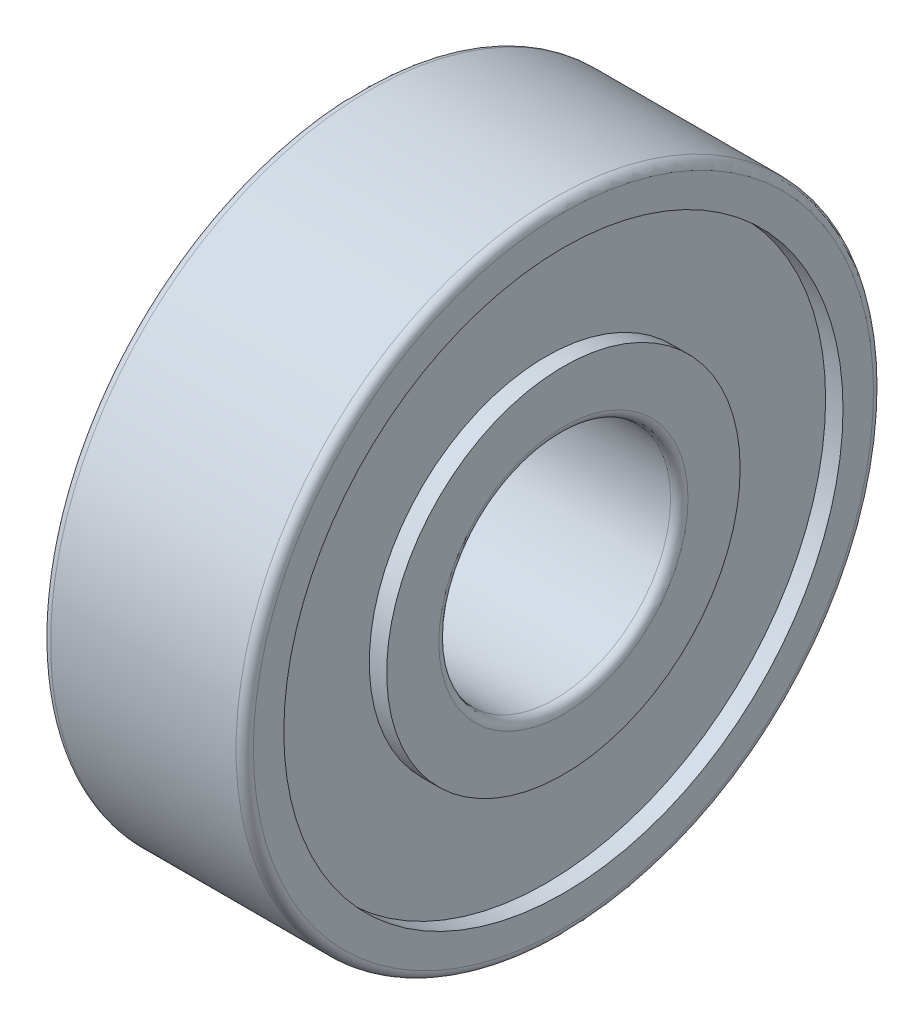
ISO-10303-21;
HEADER;
FILE_DESCRIPTION(('STEP AP214'),'2;1');
FILE_NAME('part.step','',(''),(''),'','','');
FILE_SCHEMA(('AUTOMOTIVE_DESIGN { 1 0 10303 214 1 1 1 1 }'));
ENDSEC;
DATA;
#1=APPLICATION_CONTEXT('core data for automotive mechanical design processes');
#2=APPLICATION_PROTOCOL_DEFINITION('international standard','automotive_design',2000,#1);
#3=PRODUCT_CONTEXT('',#1,'mechanical');
#4=PRODUCT('Part','Part','',(#3));
#5=PRODUCT_RELATED_PRODUCT_CATEGORY('part','',(#4));
#6=PRODUCT_DEFINITION_FORMATION('','',#4);
#7=PRODUCT_DEFINITION_CONTEXT('part definition',#1,'design');
#8=PRODUCT_DEFINITION('design','',#6,#7);
#9=PRODUCT_DEFINITION_SHAPE('','',#8);
#10=(LENGTH_UNIT() NAMED_UNIT(*) SI_UNIT(.MILLI.,.METRE.));
#11=(NAMED_UNIT(*) PLANE_ANGLE_UNIT() SI_UNIT($,.RADIAN.));
#12=(NAMED_UNIT(*) SI_UNIT($,.STERADIAN.) SOLID_ANGLE_UNIT());
#13=UNCERTAINTY_MEASURE_WITH_UNIT(LENGTH_MEASURE(1.E-05),#10,'distance_accuracy_value','');
#14=(GEOMETRIC_REPRESENTATION_CONTEXT(3) GLOBAL_UNCERTAINTY_ASSIGNED_CONTEXT((#13)) GLOBAL_UNIT_ASSIGNED_CONTEXT((#10,
#11,#12)) REPRESENTATION_CONTEXT('',''));
#15=CARTESIAN_POINT('',(0.,0.,0.));
#16=DIRECTION('',(0.,0.,1.));
#17=DIRECTION('',(1.,0.,0.));
#18=AXIS2_PLACEMENT_3D('',#15,#16,#17);
#19=CARTESIAN_POINT('',(0.3,0.,0.));
#20=DIRECTION('',(1.,0.,0.));
#21=DIRECTION('',(0.,0.,-1.));
#22=AXIS2_PLACEMENT_3D('',#19,#20,#21);
#23=TOROIDAL_SURFACE('',#22,4.3,0.3);
#24=CARTESIAN_POINT('',(0.3,0.,0.));
#25=DIRECTION('',(1.,0.,0.));
#26=DIRECTION('',(0.,0.,-1.));
#27=AXIS2_PLACEMENT_3D('',#24,#25,#26);
#28=CIRCLE('',#27,4.);
#29=CARTESIAN_POINT('',(0.3,0.,-4.));
#30=VERTEX_POINT('',#29);
#31=EDGE_CURVE('E10',#30,#30,#28,.T.);
#32=ORIENTED_EDGE('',*,*,#31,.T.);
#33=EDGE_LOOP('',(#32));
#34=FACE_BOUND('',#33,.T.);
#35=CARTESIAN_POINT('',(0.,0.,0.));
#36=DIRECTION('',(1.,0.,0.));
#37=DIRECTION('',(0.,0.,-1.));
#38=AXIS2_PLACEMENT_3D('',#35,#36,#37);
#39=CIRCLE('',#38,4.3);
#40=CARTESIAN_POINT('',(0.,0.,-4.3));
#41=VERTEX_POINT('',#40);
#42=EDGE_CURVE('E82',#41,#41,#39,.T.);
#43=ORIENTED_EDGE('',*,*,#42,.F.);
#44=EDGE_LOOP('',(#43));
#45=FACE_BOUND('',#44,.T.);
#46=ADVANCED_FACE('F30',(#34,#45),#23,.T.);
#47=CARTESIAN_POINT('',(-0.00280315790176437,0.,0.));
#48=DIRECTION('',(1.,0.,0.));
#49=DIRECTION('',(0.,0.,-1.));
#50=AXIS2_PLACEMENT_3D('',#47,#48,#49);
#51=CYLINDRICAL_SURFACE('',#50,4.);
#52=CARTESIAN_POINT('',(6.7,0.,0.));
#53=DIRECTION('',(1.,0.,0.));
#54=DIRECTION('',(0.,0.,-1.));
#55=AXIS2_PLACEMENT_3D('',#52,#53,#54);
#56=CIRCLE('',#55,4.);
#57=CARTESIAN_POINT('',(6.7,0.,-4.));
#58=VERTEX_POINT('',#57);
#59=EDGE_CURVE('E36',#58,#58,#56,.T.);
#60=ORIENTED_EDGE('',*,*,#59,.T.);
#61=EDGE_LOOP('',(#60));
#62=FACE_BOUND('',#61,.T.);
#63=ORIENTED_EDGE('',*,*,#31,.F.);
#64=EDGE_LOOP('',(#63));
#65=FACE_BOUND('',#64,.T.);
#66=ADVANCED_FACE('F90',(#62,#65),#51,.F.);
#67=CARTESIAN_POINT('',(6.7,0.,0.));
#68=DIRECTION('',(1.,0.,0.));
#69=DIRECTION('',(0.,0.,-1.));
#70=AXIS2_PLACEMENT_3D('',#67,#68,#69);
#71=TOROIDAL_SURFACE('',#70,4.3,0.299999999999999);
#72=CARTESIAN_POINT('',(7.,0.,0.));
#73=DIRECTION('',(1.,0.,0.));
#74=DIRECTION('',(0.,0.,-1.));
#75=AXIS2_PLACEMENT_3D('',#72,#73,#74);
#76=CIRCLE('',#75,4.3);
#77=CARTESIAN_POINT('',(7.,0.,-4.3));
#78=VERTEX_POINT('',#77);
#79=EDGE_CURVE('E40',#78,#78,#76,.T.);
#80=ORIENTED_EDGE('',*,*,#79,.T.);
#81=EDGE_LOOP('',(#80));
#82=FACE_BOUND('',#81,.T.);
#83=ORIENTED_EDGE('',*,*,#59,.F.);
#84=EDGE_LOOP('',(#83));
#85=FACE_BOUND('',#84,.T.);
#86=ADVANCED_FACE('F94',(#82,#85),#71,.T.);
#87=CARTESIAN_POINT('',(7.,4.3,0.));
#88=DIRECTION('',(1.,0.,0.));
#89=DIRECTION('',(0.,0.,-1.));
#90=AXIS2_PLACEMENT_3D('',#87,#88,#89);
#91=PLANE('',#90);
#92=CARTESIAN_POINT('',(7.,0.,0.));
#93=DIRECTION('',(1.,0.,0.));
#94=DIRECTION('',(0.,0.,-1.));
#95=AXIS2_PLACEMENT_3D('',#92,#93,#94);
#96=CIRCLE('',#95,6.1);
#97=CARTESIAN_POINT('',(7.,0.,-6.1));
#98=VERTEX_POINT('',#97);
#99=EDGE_CURVE('E44',#98,#98,#96,.T.);
#100=ORIENTED_EDGE('',*,*,#99,.T.);
#101=EDGE_LOOP('',(#100));
#102=FACE_BOUND('',#101,.T.);
#103=ORIENTED_EDGE('',*,*,#79,.F.);
#104=EDGE_LOOP('',(#103));
#105=FACE_BOUND('',#104,.T.);
#106=ADVANCED_FACE('F98',(#102,#105),#91,.T.);
#107=CARTESIAN_POINT('',(-0.00280315790176437,0.,0.));
#108=DIRECTION('',(1.,0.,0.));
#109=DIRECTION('',(0.,0.,-1.));
#110=AXIS2_PLACEMENT_3D('',#107,#108,#109);
#111=CYLINDRICAL_SURFACE('',#110,6.1);
#112=CARTESIAN_POINT('',(6.4,0.,0.));
#113=DIRECTION('',(1.,0.,0.));
#114=DIRECTION('',(0.,0.,-1.));
#115=AXIS2_PLACEMENT_3D('',#112,#113,#114);
#116=CIRCLE('',#115,6.1);
#117=CARTESIAN_POINT('',(6.4,0.,-6.1));
#118=VERTEX_POINT('',#117);
#119=EDGE_CURVE('E49',#118,#118,#116,.T.);
#120=ORIENTED_EDGE('',*,*,#119,.T.);
#121=EDGE_LOOP('',(#120));
#122=FACE_BOUND('',#121,.T.);
#123=ORIENTED_EDGE('',*,*,#99,.F.);
#124=EDGE_LOOP('',(#123));
#125=FACE_BOUND('',#124,.T.);
#126=ADVANCED_FACE('F105',(#122,#125),#111,.T.);
#127=CARTESIAN_POINT('',(6.4,6.1,0.));
#128=DIRECTION('',(1.,0.,0.));
#129=DIRECTION('',(0.,0.,-1.));
#130=AXIS2_PLACEMENT_3D('',#127,#128,#129);
#131=PLANE('',#130);
#132=CARTESIAN_POINT('',(6.4,0.,0.));
#133=DIRECTION('',(1.,0.,0.));
#134=DIRECTION('',(0.,0.,-1.));
#135=AXIS2_PLACEMENT_3D('',#132,#133,#134);
#136=CIRCLE('',#135,9.65);
#137=CARTESIAN_POINT('',(6.4,0.,-9.65));
#138=VERTEX_POINT('',#137);
#139=EDGE_CURVE('E52',#138,#138,#136,.T.);
#140=ORIENTED_EDGE('',*,*,#139,.T.);
#141=EDGE_LOOP('',(#140));
#142=FACE_BOUND('',#141,.T.);
#143=ORIENTED_EDGE('',*,*,#119,.F.);
#144=EDGE_LOOP('',(#143));
#145=FACE_BOUND('',#144,.T.);
#146=ADVANCED_FACE('F109',(#142,#145),#131,.T.);
#147=CARTESIAN_POINT('',(-0.00280315790176437,0.,0.));
#148=DIRECTION('',(1.,0.,0.));
#149=DIRECTION('',(0.,0.,-1.));
#150=AXIS2_PLACEMENT_3D('',#147,#148,#149);
#151=CYLINDRICAL_SURFACE('',#150,9.65);
#152=CARTESIAN_POINT('',(7.,0.,0.));
#153=DIRECTION('',(1.,0.,0.));
#154=DIRECTION('',(0.,0.,-1.));
#155=AXIS2_PLACEMENT_3D('',#152,#153,#154);
#156=CIRCLE('',#155,9.65);
#157=CARTESIAN_POINT('',(7.,0.,-9.65));
#158=VERTEX_POINT('',#157);
#159=EDGE_CURVE('E55',#158,#158,#156,.T.);
#160=ORIENTED_EDGE('',*,*,#159,.T.);
#161=EDGE_LOOP('',(#160));
#162=FACE_BOUND('',#161,.T.);
#163=ORIENTED_EDGE('',*,*,#139,.F.);
#164=EDGE_LOOP('',(#163));
#165=FACE_BOUND('',#164,.T.);
#166=ADVANCED_FACE('F113',(#162,#165),#151,.F.);
#167=CARTESIAN_POINT('',(7.,9.65,0.));
#168=DIRECTION('',(1.,0.,0.));
#169=DIRECTION('',(0.,0.,-1.));
#170=AXIS2_PLACEMENT_3D('',#167,#168,#169);
#171=PLANE('',#170);
#172=CARTESIAN_POINT('',(7.,0.,0.));
#173=DIRECTION('',(1.,0.,0.));
#174=DIRECTION('',(0.,0.,-1.));
#175=AXIS2_PLACEMENT_3D('',#172,#173,#174);
#176=CIRCLE('',#175,10.7);
#177=CARTESIAN_POINT('',(7.,0.,-10.7));
#178=VERTEX_POINT('',#177);
#179=EDGE_CURVE('E58',#178,#178,#176,.T.);
#180=ORIENTED_EDGE('',*,*,#179,.T.);
#181=EDGE_LOOP('',(#180));
#182=FACE_BOUND('',#181,.T.);
#183=ORIENTED_EDGE('',*,*,#159,.F.);
#184=EDGE_LOOP('',(#183));
#185=FACE_BOUND('',#184,.T.);
#186=ADVANCED_FACE('F117',(#182,#185),#171,.T.);
#187=CARTESIAN_POINT('',(6.7,0.,0.));
#188=DIRECTION('',(1.,0.,0.));
#189=DIRECTION('',(0.,0.,-1.));
#190=AXIS2_PLACEMENT_3D('',#187,#188,#189);
#191=TOROIDAL_SURFACE('',#190,10.7,0.3);
#192=CARTESIAN_POINT('',(6.7,0.,0.));
#193=DIRECTION('',(1.,0.,0.));
#194=DIRECTION('',(0.,0.,-1.));
#195=AXIS2_PLACEMENT_3D('',#192,#193,#194);
#196=CIRCLE('',#195,11.);
#197=CARTESIAN_POINT('',(6.7,0.,-11.));
#198=VERTEX_POINT('',#197);
#199=EDGE_CURVE('E61',#198,#198,#196,.T.);
#200=ORIENTED_EDGE('',*,*,#199,.T.);
#201=EDGE_LOOP('',(#200));
#202=FACE_BOUND('',#201,.T.);
#203=ORIENTED_EDGE('',*,*,#179,.F.);
#204=EDGE_LOOP('',(#203));
#205=FACE_BOUND('',#204,.T.);
#206=ADVANCED_FACE('F121',(#202,#205),#191,.T.);
#207=CARTESIAN_POINT('',(-0.00280315790176437,0.,0.));
#208=DIRECTION('',(1.,0.,0.));
#209=DIRECTION('',(0.,0.,-1.));
#210=AXIS2_PLACEMENT_3D('',#207,#208,#209);
#211=CYLINDRICAL_SURFACE('',#210,11.);
#212=CARTESIAN_POINT('',(0.3,0.,0.));
#213=DIRECTION('',(1.,0.,0.));
#214=DIRECTION('',(0.,0.,-1.));
#215=AXIS2_PLACEMENT_3D('',#212,#213,#214);
#216=CIRCLE('',#215,11.);
#217=CARTESIAN_POINT('',(0.3,0.,-11.));
#218=VERTEX_POINT('',#217);
#219=EDGE_CURVE('E64',#218,#218,#216,.T.);
#220=ORIENTED_EDGE('',*,*,#219,.T.);
#221=EDGE_LOOP('',(#220));
#222=FACE_BOUND('',#221,.T.);
#223=ORIENTED_EDGE('',*,*,#199,.F.);
#224=EDGE_LOOP('',(#223));
#225=FACE_BOUND('',#224,.T.);
#226=ADVANCED_FACE('F125',(#222,#225),#211,.T.);
#227=CARTESIAN_POINT('',(0.300000000000002,0.,0.));
#228=DIRECTION('',(1.,0.,0.));
#229=DIRECTION('',(0.,0.,-1.));
#230=AXIS2_PLACEMENT_3D('',#227,#228,#229);
#231=TOROIDAL_SURFACE('',#230,10.7,0.300000000000001);
#232=CARTESIAN_POINT('',(0.,0.,0.));
#233=DIRECTION('',(1.,0.,0.));
#234=DIRECTION('',(0.,0.,-1.));
#235=AXIS2_PLACEMENT_3D('',#232,#233,#234);
#236=CIRCLE('',#235,10.7);
#237=CARTESIAN_POINT('',(0.,0.,-10.7));
#238=VERTEX_POINT('',#237);
#239=EDGE_CURVE('E67',#238,#238,#236,.T.);
#240=ORIENTED_EDGE('',*,*,#239,.T.);
#241=EDGE_LOOP('',(#240));
#242=FACE_BOUND('',#241,.T.);
#243=ORIENTED_EDGE('',*,*,#219,.F.);
#244=EDGE_LOOP('',(#243));
#245=FACE_BOUND('',#244,.T.);
#246=ADVANCED_FACE('F129',(#242,#245),#231,.T.);
#247=CARTESIAN_POINT('',(0.,10.7,0.));
#248=DIRECTION('',(-1.,0.,0.));
#249=DIRECTION('',(0.,0.,1.));
#250=AXIS2_PLACEMENT_3D('',#247,#248,#249);
#251=PLANE('',#250);
#252=CARTESIAN_POINT('',(0.,0.,0.));
#253=DIRECTION('',(1.,0.,0.));
#254=DIRECTION('',(0.,0.,-1.));
#255=AXIS2_PLACEMENT_3D('',#252,#253,#254);
#256=CIRCLE('',#255,9.65);
#257=CARTESIAN_POINT('',(0.,0.,-9.65));
#258=VERTEX_POINT('',#257);
#259=EDGE_CURVE('E70',#258,#258,#256,.T.);
#260=ORIENTED_EDGE('',*,*,#259,.T.);
#261=EDGE_LOOP('',(#260));
#262=FACE_BOUND('',#261,.T.);
#263=ORIENTED_EDGE('',*,*,#239,.F.);
#264=EDGE_LOOP('',(#263));
#265=FACE_BOUND('',#264,.T.);
#266=ADVANCED_FACE('F133',(#262,#265),#251,.T.);
#267=CARTESIAN_POINT('',(-0.00280315790176437,0.,0.));
#268=DIRECTION('',(1.,0.,0.));
#269=DIRECTION('',(0.,0.,-1.));
#270=AXIS2_PLACEMENT_3D('',#267,#268,#269);
#271=CYLINDRICAL_SURFACE('',#270,9.65);
#272=CARTESIAN_POINT('',(0.6,0.,0.));
#273=DIRECTION('',(1.,0.,0.));
#274=DIRECTION('',(0.,0.,-1.));
#275=AXIS2_PLACEMENT_3D('',#272,#273,#274);
#276=CIRCLE('',#275,9.65);
#277=CARTESIAN_POINT('',(0.6,0.,-9.65));
#278=VERTEX_POINT('',#277);
#279=EDGE_CURVE('E73',#278,#278,#276,.T.);
#280=ORIENTED_EDGE('',*,*,#279,.T.);
#281=EDGE_LOOP('',(#280));
#282=FACE_BOUND('',#281,.T.);
#283=ORIENTED_EDGE('',*,*,#259,.F.);
#284=EDGE_LOOP('',(#283));
#285=FACE_BOUND('',#284,.T.);
#286=ADVANCED_FACE('F137',(#282,#285),#271,.F.);
#287=CARTESIAN_POINT('',(0.6,9.65,0.));
#288=DIRECTION('',(-1.,0.,0.));
#289=DIRECTION('',(0.,0.,1.));
#290=AXIS2_PLACEMENT_3D('',#287,#288,#289);
#291=PLANE('',#290);
#292=CARTESIAN_POINT('',(0.6,0.,0.));
#293=DIRECTION('',(1.,0.,0.));
#294=DIRECTION('',(0.,0.,-1.));
#295=AXIS2_PLACEMENT_3D('',#292,#293,#294);
#296=CIRCLE('',#295,6.1);
#297=CARTESIAN_POINT('',(0.6,0.,-6.1));
#298=VERTEX_POINT('',#297);
#299=EDGE_CURVE('E76',#298,#298,#296,.T.);
#300=ORIENTED_EDGE('',*,*,#299,.T.);
#301=EDGE_LOOP('',(#300));
#302=FACE_BOUND('',#301,.T.);
#303=ORIENTED_EDGE('',*,*,#279,.F.);
#304=EDGE_LOOP('',(#303));
#305=FACE_BOUND('',#304,.T.);
#306=ADVANCED_FACE('F141',(#302,#305),#291,.T.);
#307=CARTESIAN_POINT('',(-0.00280315790176437,0.,0.));
#308=DIRECTION('',(1.,0.,0.));
#309=DIRECTION('',(0.,0.,-1.));
#310=AXIS2_PLACEMENT_3D('',#307,#308,#309);
#311=CYLINDRICAL_SURFACE('',#310,6.1);
#312=CARTESIAN_POINT('',(0.,0.,0.));
#313=DIRECTION('',(1.,0.,0.));
#314=DIRECTION('',(0.,0.,-1.));
#315=AXIS2_PLACEMENT_3D('',#312,#313,#314);
#316=CIRCLE('',#315,6.1);
#317=CARTESIAN_POINT('',(0.,0.,-6.1));
#318=VERTEX_POINT('',#317);
#319=EDGE_CURVE('E79',#318,#318,#316,.T.);
#320=ORIENTED_EDGE('',*,*,#319,.T.);
#321=EDGE_LOOP('',(#320));
#322=FACE_BOUND('',#321,.T.);
#323=ORIENTED_EDGE('',*,*,#299,.F.);
#324=EDGE_LOOP('',(#323));
#325=FACE_BOUND('',#324,.T.);
#326=ADVANCED_FACE('F145',(#322,#325),#311,.T.);
#327=CARTESIAN_POINT('',(0.,6.1,0.));
#328=DIRECTION('',(-1.,0.,0.));
#329=DIRECTION('',(0.,0.,1.));
#330=AXIS2_PLACEMENT_3D('',#327,#328,#329);
#331=PLANE('',#330);
#332=ORIENTED_EDGE('',*,*,#42,.T.);
#333=EDGE_LOOP('',(#332));
#334=FACE_BOUND('',#333,.T.);
#335=ORIENTED_EDGE('',*,*,#319,.F.);
#336=EDGE_LOOP('',(#335));
#337=FACE_BOUND('',#336,.T.);
#338=ADVANCED_FACE('F86',(#334,#337),#331,.T.);
#339=CLOSED_SHELL('',(#46,#66,#86,#106,#126,#146,#166,#186,#206,#226,#246,#266,#286,#306,#326,#338));
#340=MANIFOLD_SOLID_BREP('B2',#339);
#341=ADVANCED_BREP_SHAPE_REPRESENTATION('',(#18,#340),#14);
#342=SHAPE_DEFINITION_REPRESENTATION(#9,#341);
ENDSEC;
END-ISO-10303-21;
